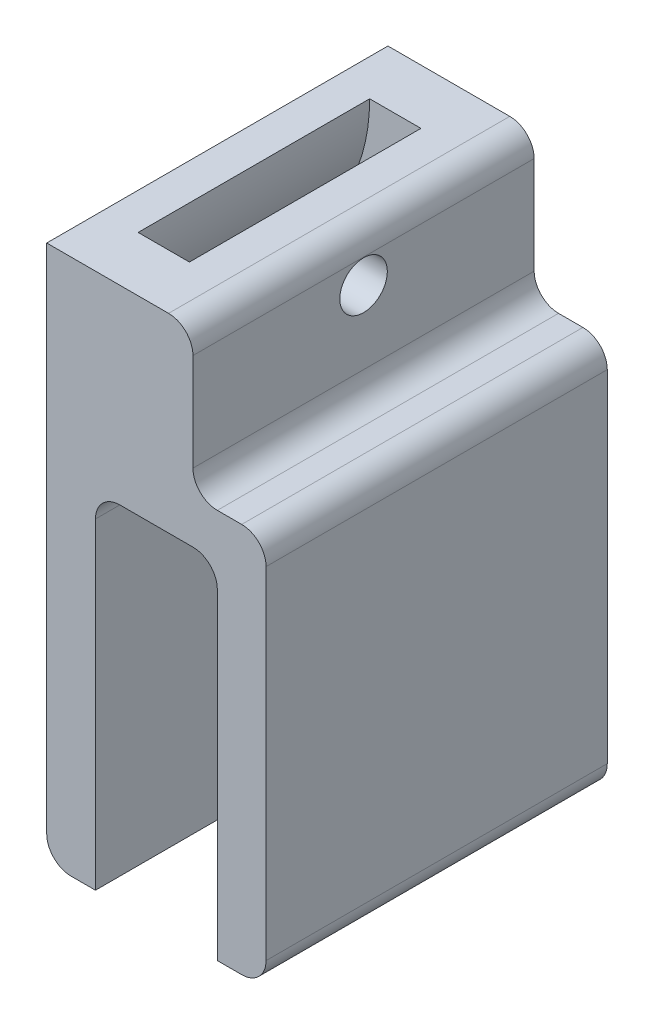
ISO-10303-21;
HEADER;
FILE_DESCRIPTION(('STEP AP214'),'2;1');
FILE_NAME('part.step','',(''),(''),'','','');
FILE_SCHEMA(('AUTOMOTIVE_DESIGN { 1 0 10303 214 1 1 1 1 }'));
ENDSEC;
DATA;
#1=APPLICATION_CONTEXT('core data for automotive mechanical design processes');
#2=APPLICATION_PROTOCOL_DEFINITION('international standard','automotive_design',2000,#1);
#3=PRODUCT_CONTEXT('',#1,'mechanical');
#4=PRODUCT('Part','Part','',(#3));
#5=PRODUCT_RELATED_PRODUCT_CATEGORY('part','',(#4));
#6=PRODUCT_DEFINITION_FORMATION('','',#4);
#7=PRODUCT_DEFINITION_CONTEXT('part definition',#1,'design');
#8=PRODUCT_DEFINITION('design','',#6,#7);
#9=PRODUCT_DEFINITION_SHAPE('','',#8);
#10=(LENGTH_UNIT() NAMED_UNIT(*) SI_UNIT(.MILLI.,.METRE.));
#11=(NAMED_UNIT(*) PLANE_ANGLE_UNIT() SI_UNIT($,.RADIAN.));
#12=(NAMED_UNIT(*) SI_UNIT($,.STERADIAN.) SOLID_ANGLE_UNIT());
#13=UNCERTAINTY_MEASURE_WITH_UNIT(LENGTH_MEASURE(1.E-05),#10,'distance_accuracy_value','');
#14=(GEOMETRIC_REPRESENTATION_CONTEXT(3) GLOBAL_UNCERTAINTY_ASSIGNED_CONTEXT((#13)) GLOBAL_UNIT_ASSIGNED_CONTEXT((#10,
#11,#12)) REPRESENTATION_CONTEXT('',''));
#15=CARTESIAN_POINT('',(0.,0.,0.));
#16=DIRECTION('',(0.,0.,1.));
#17=DIRECTION('',(1.,0.,0.));
#18=AXIS2_PLACEMENT_3D('',#15,#16,#17);
#19=CARTESIAN_POINT('',(1.,-15.,14.));
#20=DIRECTION('',(0.,0.,-1.));
#21=DIRECTION('',(-1.,0.,0.));
#22=AXIS2_PLACEMENT_3D('',#19,#20,#21);
#23=CYLINDRICAL_SURFACE('',#22,1.);
#24=DIRECTION('',(0.,0.,-1.));
#25=VECTOR('',#24,1.);
#26=CARTESIAN_POINT('',(1.00000000000001,-16.,14.));
#27=LINE('',#26,#25);
#28=CARTESIAN_POINT('',(1.,-16.,2.25));
#29=VERTEX_POINT('',#28);
#30=CARTESIAN_POINT('',(1.00000000000001,-16.,0.));
#31=VERTEX_POINT('',#30);
#32=EDGE_CURVE('E227',#29,#31,#27,.T.);
#33=ORIENTED_EDGE('',*,*,#32,.F.);
#34=CARTESIAN_POINT('',(1.,-15.,2.25));
#35=DIRECTION('',(0.,0.,-1.));
#36=DIRECTION('',(-1.,0.,0.));
#37=AXIS2_PLACEMENT_3D('',#34,#35,#36);
#38=CIRCLE('',#37,1.);
#39=CARTESIAN_POINT('',(0.,-15.,2.25));
#40=VERTEX_POINT('',#39);
#41=EDGE_CURVE('E215',#29,#40,#38,.T.);
#42=ORIENTED_EDGE('',*,*,#41,.T.);
#43=DIRECTION('',(0.,0.,-1.));
#44=VECTOR('',#43,1.);
#45=CARTESIAN_POINT('',(0.,-15.,14.));
#46=LINE('',#45,#44);
#47=CARTESIAN_POINT('',(0.,-15.,0.));
#48=VERTEX_POINT('',#47);
#49=EDGE_CURVE('E437',#40,#48,#46,.T.);
#50=ORIENTED_EDGE('',*,*,#49,.T.);
#51=CARTESIAN_POINT('',(1.,-15.,0.));
#52=DIRECTION('',(0.,0.,1.));
#53=DIRECTION('',(1.,0.,0.));
#54=AXIS2_PLACEMENT_3D('',#51,#52,#53);
#55=CIRCLE('',#54,1.);
#56=EDGE_CURVE('E229',#48,#31,#55,.T.);
#57=ORIENTED_EDGE('',*,*,#56,.T.);
#58=EDGE_LOOP('',(#33,#42,#50,#57));
#59=FACE_BOUND('',#58,.T.);
#60=ADVANCED_FACE('F43',(#59),#23,.T.);
#61=CARTESIAN_POINT('',(-6.,6.,14.));
#62=DIRECTION('',(0.,0.,1.));
#63=DIRECTION('',(1.,0.,0.));
#64=AXIS2_PLACEMENT_3D('',#61,#62,#63);
#65=CYLINDRICAL_SURFACE('',#64,9.60468635614927);
#66=CARTESIAN_POINT('',(3.54983638603301,4.975,7.));
#67=CARTESIAN_POINT('',(3.54983654030874,4.97499765923591,7.05447231909545));
#68=CARTESIAN_POINT('',(3.54934821209866,4.97041968657314,7.10898064716998));
#69=CARTESIAN_POINT('',(3.54736880381986,4.95222641165071,7.21649130415558));
#70=CARTESIAN_POINT('',(3.54587662240932,4.9386011837302,7.26949191228875));
#71=CARTESIAN_POINT('',(3.54181811341177,4.90271642328877,7.37241888516331));
#72=CARTESIAN_POINT('',(3.53925227655186,4.88046083571721,7.42234664244431));
#73=CARTESIAN_POINT('',(3.53294624495043,4.82797996611845,7.51772251808905));
#74=CARTESIAN_POINT('',(3.5292063269554,4.79775656247985,7.56317168880137));
#75=CARTESIAN_POINT('',(3.52044099785097,4.7302125323965,7.64836058331503));
#76=CARTESIAN_POINT('',(3.51541465373154,4.69288675985773,7.68809613037267));
#77=CARTESIAN_POINT('',(3.50399104781962,4.61226505089509,7.76072364824368));
#78=CARTESIAN_POINT('',(3.49759373451121,4.5689688901481,7.79361536179973));
#79=CARTESIAN_POINT('',(3.48335901753042,4.47748533616389,7.85181273167091));
#80=CARTESIAN_POINT('',(3.47551529371861,4.42927690917059,7.87708375978909));
#81=CARTESIAN_POINT('',(3.45844300264154,4.32954687960288,7.91921422709139));
#82=CARTESIAN_POINT('',(3.4492143648559,4.278025108388,7.93607323774288));
#83=CARTESIAN_POINT('',(3.42937094334267,4.17246546422073,7.96117706650691));
#84=CARTESIAN_POINT('',(3.41873997446763,4.118403873929,7.96930921857102));
#85=CARTESIAN_POINT('',(3.39641281472078,4.00990069386823,7.97646516150323));
#86=CARTESIAN_POINT('',(3.38471650157542,3.95545906114409,7.97548790554279));
#87=CARTESIAN_POINT('',(3.36032475804199,3.84651407788624,7.96443133741383));
#88=CARTESIAN_POINT('',(3.34761342704867,3.79203378076364,7.95415993055693));
#89=CARTESIAN_POINT('',(3.32184749575125,3.68566272953433,7.92458940475705));
#90=CARTESIAN_POINT('',(3.3087928476682,3.6337723388044,7.90528902292245));
#91=CARTESIAN_POINT('',(3.28261566303421,3.53305784188207,7.85775636175943));
#92=CARTESIAN_POINT('',(3.26949614255724,3.48430584385074,7.82936939045021));
#93=CARTESIAN_POINT('',(3.24402932362007,3.39227978544993,7.76450643648993));
#94=CARTESIAN_POINT('',(3.23168205240017,3.3490059182608,7.72803016870334));
#95=CARTESIAN_POINT('',(3.2084551574588,3.26941999160748,7.64810685637921));
#96=CARTESIAN_POINT('',(3.19756872444456,3.23307527438886,7.60469437837582));
#97=CARTESIAN_POINT('',(3.17782646398492,3.1682774184293,7.5119196051189));
#98=CARTESIAN_POINT('',(3.16897018463755,3.13982252315767,7.46255863770875));
#99=CARTESIAN_POINT('',(3.15413100592176,3.09268553315065,7.36113808758908));
#100=CARTESIAN_POINT('',(3.14805723317411,3.07369226233307,7.3092365944666));
#101=CARTESIAN_POINT('',(3.13873830526483,3.04471705605947,7.20273655754587));
#102=CARTESIAN_POINT('',(3.13549227182808,3.03473232258326,7.14813885674118));
#103=CARTESIAN_POINT('',(3.13213035559415,3.02439538030788,7.04032947386713));
#104=CARTESIAN_POINT('',(3.13188554839029,3.02364641963207,6.98715952780095));
#105=CARTESIAN_POINT('',(3.13420873708317,3.0307838376518,6.88146933238586));
#106=CARTESIAN_POINT('',(3.13677644011061,3.03866931723506,6.82894901596628));
#107=CARTESIAN_POINT('',(3.14450043637465,3.06260913711738,6.72680215465763));
#108=CARTESIAN_POINT('',(3.1496195732731,3.0785462660648,6.67714517141976));
#109=CARTESIAN_POINT('',(3.16211772278648,3.11798259991648,6.58124046183783));
#110=CARTESIAN_POINT('',(3.1694969778997,3.14148261629083,6.53499310198859));
#111=CARTESIAN_POINT('',(3.18632151928051,3.19601549150868,6.44589490445011));
#112=CARTESIAN_POINT('',(3.19581547507336,3.22722809726801,6.40316343649703));
#113=CARTESIAN_POINT('',(3.21625041298274,3.29592703237969,6.32348302674362));
#114=CARTESIAN_POINT('',(3.22719170731665,3.33341471584539,6.28653533637525));
#115=CARTESIAN_POINT('',(3.25050644740504,3.41542599050691,6.21776896043653));
#116=CARTESIAN_POINT('',(3.26292165715062,3.46018604248259,6.18624626663587));
#117=CARTESIAN_POINT('',(3.28819969319982,3.55424511891968,6.13115037404116));
#118=CARTESIAN_POINT('',(3.30106259938319,3.6035449559965,6.10757860198622));
#119=CARTESIAN_POINT('',(3.32709390086703,3.70691481111203,6.06840472997474));
#120=CARTESIAN_POINT('',(3.34026007792542,3.76108279438388,6.05305899500714));
#121=CARTESIAN_POINT('',(3.36601334735681,3.87138534670266,6.03189000496204));
#122=CARTESIAN_POINT('',(3.378600427469,3.92751995734328,6.02606695141127));
#123=CARTESIAN_POINT('',(3.40278202337554,4.04015152975417,6.02420104957862));
#124=CARTESIAN_POINT('',(3.41437686442026,4.09664836621085,6.0281549836519));
#125=CARTESIAN_POINT('',(3.43627176452015,4.20834875580097,6.04584482013082));
#126=CARTESIAN_POINT('',(3.44657196434991,4.26355244901409,6.05957965791195));
#127=CARTESIAN_POINT('',(3.46549384696576,4.36988137607817,6.09616903647167));
#128=CARTESIAN_POINT('',(3.47414507128788,4.42106623222123,6.11883499194005));
#129=CARTESIAN_POINT('',(3.48994365013321,4.51897642042101,6.17270962042132));
#130=CARTESIAN_POINT('',(3.4970912271076,4.56570241156728,6.20391702822863));
#131=CARTESIAN_POINT('',(3.50976842934507,4.65234025419154,6.27329824839414));
#132=CARTESIAN_POINT('',(3.5153277939297,4.69237058585842,6.31131877139638));
#133=CARTESIAN_POINT('',(3.52509500081151,4.76552402696147,6.39367416387762));
#134=CARTESIAN_POINT('',(3.5293026162104,4.79864597646193,6.43801009163007));
#135=CARTESIAN_POINT('',(3.53643675482766,4.85666166364111,6.53123441286501));
#136=CARTESIAN_POINT('',(3.53937576599784,4.88163498933292,6.58007240328522));
#137=CARTESIAN_POINT('',(3.54413947642016,4.92304134276015,6.68125084241746));
#138=CARTESIAN_POINT('',(3.54596542583934,4.93948394891312,6.73358728812121));
#139=CARTESIAN_POINT('',(3.54813648666241,4.9592561157567,6.82184826605894));
#140=CARTESIAN_POINT('',(3.548775078046,4.96515199161104,6.85721227074612));
#141=CARTESIAN_POINT('',(3.54962497682726,4.97302470164829,6.92837899410916));
#142=CARTESIAN_POINT('',(3.54983628458896,4.97500153917004,6.96418171241123));
#143=CARTESIAN_POINT('',(3.54983638603301,4.975,7.));
#144=B_SPLINE_CURVE_WITH_KNOTS('',3,(#66,#67,#68,#69,#70,#71,#72,#73,#74,#75,#76,#77,#78,#79,
#80,#81,#82,#83,#84,#85,#86,#87,#88,#89,#90,#91,#92,#93,#94,#95,#96,#97,#98,#99,#100,#101,#102,
#103,#104,#105,#106,#107,#108,#109,#110,#111,#112,#113,#114,#115,#116,#117,#118,#119,#120,#121,
#122,#123,#124,#125,#126,#127,#128,#129,#130,#131,#132,#133,#134,#135,#136,#137,#138,#139,#140,
#141,#142,#143),.UNSPECIFIED.,.T.,.F.,(4,2,2,2,2,2,2,2,2,2,2,2,2,2,2,2,2,2,2,2,2,2,2,2,2,2,2,2,
2,2,2,2,2,2,2,2,2,2,4),(0.,0.163286544600321,0.326752526007672,0.490143874798602,
0.653496738963686,0.816968415943527,0.980446236656639,1.14465607520607,1.308874278228,
1.47518797829279,1.64152079091418,1.81137197113816,1.98124691572034,2.15418313912827,
2.32712545924717,2.49923136439582,2.67129892235669,2.83725581922321,3.00316115269537,
3.16191335990958,3.32064903768097,3.47713778995856,3.63364333850653,3.79421255191043,
3.95481645968593,4.1224636367053,4.29014088089256,4.46277797040424,4.63541871335547,
4.80800264712612,4.98056779848004,5.14966920304122,5.31874557294177,5.48441000955807,
5.65010223932107,5.81412400562731,5.97796120512279,6.08533040646702,6.19269951633773),.UNSPECIFIED.);
#145=CARTESIAN_POINT('',(3.54983638603301,4.975,7.));
#146=VERTEX_POINT('',#145);
#147=EDGE_CURVE('E251',#146,#146,#144,.T.);
#148=ORIENTED_EDGE('',*,*,#147,.T.);
#149=EDGE_LOOP('',(#148));
#150=FACE_BOUND('',#149,.T.);
#151=CARTESIAN_POINT('',(-6.,6.,2.25));
#152=DIRECTION('',(0.,0.,1.));
#153=DIRECTION('',(0.624695047554424,-0.78086880944303,0.));
#154=AXIS2_PLACEMENT_3D('',#151,#152,#153);
#155=CIRCLE('',#154,9.60468635614927);
#156=CARTESIAN_POINT('',(1.76582033218927,0.34827154154097,2.25));
#157=VERTEX_POINT('',#156);
#158=CARTESIAN_POINT('',(3.60468635614927,6.,2.25));
#159=VERTEX_POINT('',#158);
#160=EDGE_CURVE('E258',#157,#159,#155,.T.);
#161=ORIENTED_EDGE('',*,*,#160,.F.);
#162=DIRECTION('',(0.,0.,1.));
#163=VECTOR('',#162,1.);
#164=CARTESIAN_POINT('',(1.76582033218927,0.348271541540971,14.));
#165=LINE('',#164,#163);
#166=CARTESIAN_POINT('',(1.76582033218927,0.34827154154097,11.75));
#167=VERTEX_POINT('',#166);
#168=EDGE_CURVE('E65',#157,#167,#165,.T.);
#169=ORIENTED_EDGE('',*,*,#168,.T.);
#170=CARTESIAN_POINT('',(-6.,6.,11.75));
#171=DIRECTION('',(0.,0.,1.));
#172=DIRECTION('',(0.624695047554424,-0.78086880944303,0.));
#173=AXIS2_PLACEMENT_3D('',#170,#171,#172);
#174=CIRCLE('',#173,9.60468635614927);
#175=CARTESIAN_POINT('',(3.60468635614927,6.,11.75));
#176=VERTEX_POINT('',#175);
#177=EDGE_CURVE('E255',#167,#176,#174,.T.);
#178=ORIENTED_EDGE('',*,*,#177,.T.);
#179=DIRECTION('',(0.,0.,1.));
#180=VECTOR('',#179,1.);
#181=CARTESIAN_POINT('',(3.60468635614927,6.,14.));
#182=LINE('',#181,#180);
#183=EDGE_CURVE('E446',#159,#176,#182,.T.);
#184=ORIENTED_EDGE('',*,*,#183,.F.);
#185=EDGE_LOOP('',(#161,#169,#178,#184));
#186=FACE_BOUND('',#185,.T.);
#187=ADVANCED_FACE('F467',(#150,#186),#65,.F.);
#188=CARTESIAN_POINT('',(0.,0.,14.));
#189=DIRECTION('',(1.,0.,0.));
#190=DIRECTION('',(0.,1.,0.));
#191=AXIS2_PLACEMENT_3D('',#188,#189,#190);
#192=PLANE('',#191);
#193=ORIENTED_EDGE('',*,*,#49,.F.);
#194=DIRECTION('',(0.,-1.,0.));
#195=VECTOR('',#194,1.);
#196=CARTESIAN_POINT('',(0.,1.5,2.25));
#197=LINE('',#196,#195);
#198=CARTESIAN_POINT('',(0.,1.5,2.25));
#199=VERTEX_POINT('',#198);
#200=EDGE_CURVE('E219',#40,#199,#197,.F.);
#201=ORIENTED_EDGE('',*,*,#200,.T.);
#202=DIRECTION('',(0.,0.,1.));
#203=VECTOR('',#202,1.);
#204=CARTESIAN_POINT('',(0.,1.5,2.25));
#205=LINE('',#204,#203);
#206=CARTESIAN_POINT('',(0.,1.5,11.75));
#207=VERTEX_POINT('',#206);
#208=EDGE_CURVE('E262',#199,#207,#205,.T.);
#209=ORIENTED_EDGE('',*,*,#208,.T.);
#210=DIRECTION('',(0.,-1.,0.));
#211=VECTOR('',#210,1.);
#212=CARTESIAN_POINT('',(0.,1.5,11.75));
#213=LINE('',#212,#211);
#214=CARTESIAN_POINT('',(0.,-15.,11.75));
#215=VERTEX_POINT('',#214);
#216=EDGE_CURVE('E252',#207,#215,#213,.T.);
#217=ORIENTED_EDGE('',*,*,#216,.T.);
#218=CARTESIAN_POINT('',(0.,-15.,14.));
#219=VERTEX_POINT('',#218);
#220=EDGE_CURVE('E438',#219,#215,#46,.T.);
#221=ORIENTED_EDGE('',*,*,#220,.F.);
#222=DIRECTION('',(0.,-1.,0.));
#223=VECTOR('',#222,1.);
#224=CARTESIAN_POINT('',(0.,0.,14.));
#225=LINE('',#224,#223);
#226=CARTESIAN_POINT('',(0.,6.,14.));
#227=VERTEX_POINT('',#226);
#228=EDGE_CURVE('E275',#227,#219,#225,.T.);
#229=ORIENTED_EDGE('',*,*,#228,.F.);
#230=DIRECTION('',(0.,0.,-1.));
#231=VECTOR('',#230,1.);
#232=CARTESIAN_POINT('',(0.,6.,14.));
#233=LINE('',#232,#231);
#234=CARTESIAN_POINT('',(0.,6.,0.));
#235=VERTEX_POINT('',#234);
#236=EDGE_CURVE('E327',#227,#235,#233,.T.);
#237=ORIENTED_EDGE('',*,*,#236,.T.);
#238=DIRECTION('',(0.,-1.,0.));
#239=VECTOR('',#238,1.);
#240=CARTESIAN_POINT('',(0.,0.,0.));
#241=LINE('',#240,#239);
#242=EDGE_CURVE('E271',#235,#48,#241,.T.);
#243=ORIENTED_EDGE('',*,*,#242,.T.);
#244=EDGE_LOOP('',(#193,#201,#209,#217,#221,#229,#237,#243));
#245=FACE_BOUND('',#244,.T.);
#246=ADVANCED_FACE('F490',(#245),#192,.F.);
#247=ORIENTED_EDGE('',*,*,#220,.T.);
#248=CARTESIAN_POINT('',(1.,-15.,11.75));
#249=DIRECTION('',(0.,0.,1.));
#250=DIRECTION('',(1.,0.,0.));
#251=AXIS2_PLACEMENT_3D('',#248,#249,#250);
#252=CIRCLE('',#251,1.);
#253=CARTESIAN_POINT('',(1.,-16.,11.75));
#254=VERTEX_POINT('',#253);
#255=EDGE_CURVE('E224',#215,#254,#252,.T.);
#256=ORIENTED_EDGE('',*,*,#255,.T.);
#257=CARTESIAN_POINT('',(1.00000000000001,-16.,14.));
#258=VERTEX_POINT('',#257);
#259=EDGE_CURVE('E233',#258,#254,#27,.T.);
#260=ORIENTED_EDGE('',*,*,#259,.F.);
#261=CARTESIAN_POINT('',(1.,-15.,14.));
#262=DIRECTION('',(0.,0.,1.));
#263=DIRECTION('',(1.,0.,0.));
#264=AXIS2_PLACEMENT_3D('',#261,#262,#263);
#265=CIRCLE('',#264,1.);
#266=EDGE_CURVE('E278',#219,#258,#265,.T.);
#267=ORIENTED_EDGE('',*,*,#266,.F.);
#268=EDGE_LOOP('',(#247,#256,#260,#267));
#269=FACE_BOUND('',#268,.T.);
#270=ADVANCED_FACE('F486',(#269),#23,.T.);
#271=CARTESIAN_POINT('',(1.00000000000001,-16.,14.));
#272=DIRECTION('',(0.,1.,0.));
#273=DIRECTION('',(0.,0.,1.));
#274=AXIS2_PLACEMENT_3D('',#271,#272,#273);
#275=PLANE('',#274);
#276=DIRECTION('',(1.,0.,0.));
#277=VECTOR('',#276,1.);
#278=CARTESIAN_POINT('',(1.00000000000001,-16.,0.));
#279=LINE('',#278,#277);
#280=CARTESIAN_POINT('',(2.,-16.,0.));
#281=VERTEX_POINT('',#280);
#282=EDGE_CURVE('E333',#31,#281,#279,.T.);
#283=ORIENTED_EDGE('',*,*,#282,.T.);
#284=DIRECTION('',(0.,0.,-1.));
#285=VECTOR('',#284,1.);
#286=CARTESIAN_POINT('',(2.,-16.,14.));
#287=LINE('',#286,#285);
#288=CARTESIAN_POINT('',(2.,-16.,14.));
#289=VERTEX_POINT('',#288);
#290=EDGE_CURVE('E234',#289,#281,#287,.T.);
#291=ORIENTED_EDGE('',*,*,#290,.F.);
#292=DIRECTION('',(1.,0.,0.));
#293=VECTOR('',#292,1.);
#294=CARTESIAN_POINT('',(1.00000000000001,-16.,14.));
#295=LINE('',#294,#293);
#296=EDGE_CURVE('E282',#258,#289,#295,.T.);
#297=ORIENTED_EDGE('',*,*,#296,.F.);
#298=ORIENTED_EDGE('',*,*,#259,.T.);
#299=DIRECTION('',(0.,0.,1.));
#300=VECTOR('',#299,1.);
#301=CARTESIAN_POINT('',(1.,-16.,2.25));
#302=LINE('',#301,#300);
#303=EDGE_CURVE('E208',#29,#254,#302,.T.);
#304=ORIENTED_EDGE('',*,*,#303,.F.);
#305=ORIENTED_EDGE('',*,*,#32,.T.);
#306=EDGE_LOOP('',(#283,#291,#297,#298,#304,#305));
#307=FACE_BOUND('',#306,.T.);
#308=ADVANCED_FACE('F237',(#307),#275,.F.);
#309=CARTESIAN_POINT('',(2.,-16.,14.));
#310=DIRECTION('',(-1.,0.,0.));
#311=DIRECTION('',(0.,0.,1.));
#312=AXIS2_PLACEMENT_3D('',#309,#310,#311);
#313=PLANE('',#312);
#314=DIRECTION('',(0.,1.,0.));
#315=VECTOR('',#314,1.);
#316=CARTESIAN_POINT('',(2.,-16.,0.));
#317=LINE('',#316,#315);
#318=CARTESIAN_POINT('',(2.,-2.80681818181819,0.));
#319=VERTEX_POINT('',#318);
#320=EDGE_CURVE('E336',#281,#319,#317,.T.);
#321=ORIENTED_EDGE('',*,*,#320,.T.);
#322=DIRECTION('',(0.,0.,-1.));
#323=VECTOR('',#322,1.);
#324=CARTESIAN_POINT('',(2.,-2.80681818181819,14.));
#325=LINE('',#324,#323);
#326=CARTESIAN_POINT('',(2.,-2.80681818181819,14.));
#327=VERTEX_POINT('',#326);
#328=EDGE_CURVE('E429',#327,#319,#325,.T.);
#329=ORIENTED_EDGE('',*,*,#328,.F.);
#330=DIRECTION('',(0.,1.,0.));
#331=VECTOR('',#330,1.);
#332=CARTESIAN_POINT('',(2.,-16.,14.));
#333=LINE('',#332,#331);
#334=EDGE_CURVE('E285',#289,#327,#333,.T.);
#335=ORIENTED_EDGE('',*,*,#334,.F.);
#336=ORIENTED_EDGE('',*,*,#290,.T.);
#337=EDGE_LOOP('',(#321,#329,#335,#336));
#338=FACE_BOUND('',#337,.T.);
#339=ADVANCED_FACE('F499',(#338),#313,.F.);
#340=CARTESIAN_POINT('',(3.,-2.80681818181818,14.));
#341=DIRECTION('',(0.,0.,-1.));
#342=DIRECTION('',(-1.,0.,0.));
#343=AXIS2_PLACEMENT_3D('',#340,#341,#342);
#344=CYLINDRICAL_SURFACE('',#343,1.);
#345=CARTESIAN_POINT('',(3.,-2.80681818181818,0.));
#346=DIRECTION('',(0.,0.,-1.));
#347=DIRECTION('',(-1.,0.,0.));
#348=AXIS2_PLACEMENT_3D('',#345,#346,#347);
#349=CIRCLE('',#348,1.);
#350=CARTESIAN_POINT('',(3.00000000000001,-1.80681818181818,0.));
#351=VERTEX_POINT('',#350);
#352=EDGE_CURVE('E339',#319,#351,#349,.T.);
#353=ORIENTED_EDGE('',*,*,#352,.T.);
#354=DIRECTION('',(0.,0.,-1.));
#355=VECTOR('',#354,1.);
#356=CARTESIAN_POINT('',(3.00000000000001,-1.80681818181818,14.));
#357=LINE('',#356,#355);
#358=CARTESIAN_POINT('',(3.00000000000001,-1.80681818181818,14.));
#359=VERTEX_POINT('',#358);
#360=EDGE_CURVE('E425',#359,#351,#357,.T.);
#361=ORIENTED_EDGE('',*,*,#360,.F.);
#362=CARTESIAN_POINT('',(3.,-2.80681818181818,14.));
#363=DIRECTION('',(0.,0.,-1.));
#364=DIRECTION('',(-1.,0.,0.));
#365=AXIS2_PLACEMENT_3D('',#362,#363,#364);
#366=CIRCLE('',#365,1.);
#367=EDGE_CURVE('E288',#327,#359,#366,.T.);
#368=ORIENTED_EDGE('',*,*,#367,.F.);
#369=ORIENTED_EDGE('',*,*,#328,.T.);
#370=EDGE_LOOP('',(#353,#361,#368,#369));
#371=FACE_BOUND('',#370,.T.);
#372=ADVANCED_FACE('F585',(#371),#344,.F.);
#373=CARTESIAN_POINT('',(3.00000000000001,-1.80681818181818,14.));
#374=DIRECTION('',(0.,1.,0.));
#375=DIRECTION('',(0.,0.,1.));
#376=AXIS2_PLACEMENT_3D('',#373,#374,#375);
#377=PLANE('',#376);
#378=DIRECTION('',(1.,0.,0.));
#379=VECTOR('',#378,1.);
#380=CARTESIAN_POINT('',(3.00000000000001,-1.80681818181818,0.));
#381=LINE('',#380,#379);
#382=CARTESIAN_POINT('',(5.99999999999999,-1.80681818181818,0.));
#383=VERTEX_POINT('',#382);
#384=EDGE_CURVE('E342',#351,#383,#381,.T.);
#385=ORIENTED_EDGE('',*,*,#384,.T.);
#386=DIRECTION('',(0.,0.,-1.));
#387=VECTOR('',#386,1.);
#388=CARTESIAN_POINT('',(5.99999999999999,-1.80681818181818,14.));
#389=LINE('',#388,#387);
#390=CARTESIAN_POINT('',(5.99999999999999,-1.80681818181818,14.));
#391=VERTEX_POINT('',#390);
#392=EDGE_CURVE('E421',#391,#383,#389,.T.);
#393=ORIENTED_EDGE('',*,*,#392,.F.);
#394=DIRECTION('',(1.,0.,0.));
#395=VECTOR('',#394,1.);
#396=CARTESIAN_POINT('',(3.00000000000001,-1.80681818181818,14.));
#397=LINE('',#396,#395);
#398=EDGE_CURVE('E291',#359,#391,#397,.T.);
#399=ORIENTED_EDGE('',*,*,#398,.F.);
#400=ORIENTED_EDGE('',*,*,#360,.T.);
#401=EDGE_LOOP('',(#385,#393,#399,#400));
#402=FACE_BOUND('',#401,.T.);
#403=ADVANCED_FACE('F583',(#402),#377,.F.);
#404=CARTESIAN_POINT('',(6.,-2.80681818181818,14.));
#405=DIRECTION('',(0.,0.,-1.));
#406=DIRECTION('',(-1.,0.,0.));
#407=AXIS2_PLACEMENT_3D('',#404,#405,#406);
#408=CYLINDRICAL_SURFACE('',#407,1.);
#409=CARTESIAN_POINT('',(6.,-2.80681818181818,0.));
#410=DIRECTION('',(0.,0.,-1.));
#411=DIRECTION('',(-1.,0.,0.));
#412=AXIS2_PLACEMENT_3D('',#409,#410,#411);
#413=CIRCLE('',#412,1.);
#414=CARTESIAN_POINT('',(7.,-2.80681818181819,0.));
#415=VERTEX_POINT('',#414);
#416=EDGE_CURVE('E345',#383,#415,#413,.T.);
#417=ORIENTED_EDGE('',*,*,#416,.T.);
#418=DIRECTION('',(0.,0.,-1.));
#419=VECTOR('',#418,1.);
#420=CARTESIAN_POINT('',(7.,-2.80681818181819,14.));
#421=LINE('',#420,#419);
#422=CARTESIAN_POINT('',(7.,-2.80681818181819,14.));
#423=VERTEX_POINT('',#422);
#424=EDGE_CURVE('E417',#423,#415,#421,.T.);
#425=ORIENTED_EDGE('',*,*,#424,.F.);
#426=CARTESIAN_POINT('',(6.,-2.80681818181818,14.));
#427=DIRECTION('',(0.,0.,-1.));
#428=DIRECTION('',(-1.,0.,0.));
#429=AXIS2_PLACEMENT_3D('',#426,#427,#428);
#430=CIRCLE('',#429,1.);
#431=EDGE_CURVE('E294',#391,#423,#430,.T.);
#432=ORIENTED_EDGE('',*,*,#431,.F.);
#433=ORIENTED_EDGE('',*,*,#392,.T.);
#434=EDGE_LOOP('',(#417,#425,#432,#433));
#435=FACE_BOUND('',#434,.T.);
#436=ADVANCED_FACE('F578',(#435),#408,.F.);
#437=CARTESIAN_POINT('',(7.,-16.,14.));
#438=DIRECTION('',(1.,0.,0.));
#439=DIRECTION('',(0.,0.,-1.));
#440=AXIS2_PLACEMENT_3D('',#437,#438,#439);
#441=PLANE('',#440);
#442=DIRECTION('',(0.,-1.,0.));
#443=VECTOR('',#442,1.);
#444=CARTESIAN_POINT('',(7.,-16.,0.));
#445=LINE('',#444,#443);
#446=CARTESIAN_POINT('',(7.,-16.,0.));
#447=VERTEX_POINT('',#446);
#448=EDGE_CURVE('E348',#415,#447,#445,.T.);
#449=ORIENTED_EDGE('',*,*,#448,.T.);
#450=DIRECTION('',(0.,0.,-1.));
#451=VECTOR('',#450,1.);
#452=CARTESIAN_POINT('',(7.,-16.,14.));
#453=LINE('',#452,#451);
#454=CARTESIAN_POINT('',(7.,-16.,14.));
#455=VERTEX_POINT('',#454);
#456=EDGE_CURVE('E413',#455,#447,#453,.T.);
#457=ORIENTED_EDGE('',*,*,#456,.F.);
#458=DIRECTION('',(0.,-1.,0.));
#459=VECTOR('',#458,1.);
#460=CARTESIAN_POINT('',(7.,-16.,14.));
#461=LINE('',#460,#459);
#462=EDGE_CURVE('E297',#423,#455,#461,.T.);
#463=ORIENTED_EDGE('',*,*,#462,.F.);
#464=ORIENTED_EDGE('',*,*,#424,.T.);
#465=EDGE_LOOP('',(#449,#457,#463,#464));
#466=FACE_BOUND('',#465,.T.);
#467=ADVANCED_FACE('F573',(#466),#441,.F.);
#468=CARTESIAN_POINT('',(7.,-16.,14.));
#469=DIRECTION('',(0.,1.,0.));
#470=DIRECTION('',(0.,0.,1.));
#471=AXIS2_PLACEMENT_3D('',#468,#469,#470);
#472=PLANE('',#471);
#473=DIRECTION('',(1.,0.,0.));
#474=VECTOR('',#473,1.);
#475=CARTESIAN_POINT('',(7.,-16.,0.));
#476=LINE('',#475,#474);
#477=CARTESIAN_POINT('',(7.99999999999999,-16.,0.));
#478=VERTEX_POINT('',#477);
#479=EDGE_CURVE('E351',#447,#478,#476,.T.);
#480=ORIENTED_EDGE('',*,*,#479,.T.);
#481=DIRECTION('',(0.,0.,-1.));
#482=VECTOR('',#481,1.);
#483=CARTESIAN_POINT('',(7.99999999999999,-16.,14.));
#484=LINE('',#483,#482);
#485=CARTESIAN_POINT('',(7.99999999999999,-16.,14.));
#486=VERTEX_POINT('',#485);
#487=EDGE_CURVE('E409',#486,#478,#484,.T.);
#488=ORIENTED_EDGE('',*,*,#487,.F.);
#489=DIRECTION('',(1.,0.,0.));
#490=VECTOR('',#489,1.);
#491=CARTESIAN_POINT('',(7.,-16.,14.));
#492=LINE('',#491,#490);
#493=EDGE_CURVE('E300',#455,#486,#492,.T.);
#494=ORIENTED_EDGE('',*,*,#493,.F.);
#495=ORIENTED_EDGE('',*,*,#456,.T.);
#496=EDGE_LOOP('',(#480,#488,#494,#495));
#497=FACE_BOUND('',#496,.T.);
#498=ADVANCED_FACE('F569',(#497),#472,.F.);
#499=CARTESIAN_POINT('',(8.,-15.,14.));
#500=DIRECTION('',(0.,0.,-1.));
#501=DIRECTION('',(-1.,0.,0.));
#502=AXIS2_PLACEMENT_3D('',#499,#500,#501);
#503=CYLINDRICAL_SURFACE('',#502,0.999999999999999);
#504=CARTESIAN_POINT('',(8.,-15.,0.));
#505=DIRECTION('',(0.,0.,1.));
#506=DIRECTION('',(1.,0.,0.));
#507=AXIS2_PLACEMENT_3D('',#504,#505,#506);
#508=CIRCLE('',#507,0.999999999999999);
#509=CARTESIAN_POINT('',(9.,-15.,0.));
#510=VERTEX_POINT('',#509);
#511=EDGE_CURVE('E354',#478,#510,#508,.T.);
#512=ORIENTED_EDGE('',*,*,#511,.T.);
#513=DIRECTION('',(0.,0.,-1.));
#514=VECTOR('',#513,1.);
#515=CARTESIAN_POINT('',(9.,-15.,14.));
#516=LINE('',#515,#514);
#517=CARTESIAN_POINT('',(9.,-15.,14.));
#518=VERTEX_POINT('',#517);
#519=EDGE_CURVE('E405',#518,#510,#516,.T.);
#520=ORIENTED_EDGE('',*,*,#519,.F.);
#521=CARTESIAN_POINT('',(8.,-15.,14.));
#522=DIRECTION('',(0.,0.,1.));
#523=DIRECTION('',(1.,0.,0.));
#524=AXIS2_PLACEMENT_3D('',#521,#522,#523);
#525=CIRCLE('',#524,0.999999999999999);
#526=EDGE_CURVE('E303',#486,#518,#525,.T.);
#527=ORIENTED_EDGE('',*,*,#526,.F.);
#528=ORIENTED_EDGE('',*,*,#487,.T.);
#529=EDGE_LOOP('',(#512,#520,#527,#528));
#530=FACE_BOUND('',#529,.T.);
#531=ADVANCED_FACE('F564',(#530),#503,.T.);
#532=CARTESIAN_POINT('',(9.,-1.00000000000001,14.));
#533=DIRECTION('',(-1.,0.,0.));
#534=DIRECTION('',(0.,0.,1.));
#535=AXIS2_PLACEMENT_3D('',#532,#533,#534);
#536=PLANE('',#535);
#537=DIRECTION('',(0.,1.,0.));
#538=VECTOR('',#537,1.);
#539=CARTESIAN_POINT('',(9.,-1.00000000000001,0.));
#540=LINE('',#539,#538);
#541=CARTESIAN_POINT('',(9.,-1.00000000000001,0.));
#542=VERTEX_POINT('',#541);
#543=EDGE_CURVE('E357',#510,#542,#540,.T.);
#544=ORIENTED_EDGE('',*,*,#543,.T.);
#545=DIRECTION('',(0.,0.,-1.));
#546=VECTOR('',#545,1.);
#547=CARTESIAN_POINT('',(9.,-1.00000000000001,14.));
#548=LINE('',#547,#546);
#549=CARTESIAN_POINT('',(9.,-1.00000000000001,14.));
#550=VERTEX_POINT('',#549);
#551=EDGE_CURVE('E401',#550,#542,#548,.T.);
#552=ORIENTED_EDGE('',*,*,#551,.F.);
#553=DIRECTION('',(0.,1.,0.));
#554=VECTOR('',#553,1.);
#555=CARTESIAN_POINT('',(9.,-1.00000000000001,14.));
#556=LINE('',#555,#554);
#557=EDGE_CURVE('E306',#518,#550,#556,.T.);
#558=ORIENTED_EDGE('',*,*,#557,.F.);
#559=ORIENTED_EDGE('',*,*,#519,.T.);
#560=EDGE_LOOP('',(#544,#552,#558,#559));
#561=FACE_BOUND('',#560,.T.);
#562=ADVANCED_FACE('F558',(#561),#536,.F.);
#563=CARTESIAN_POINT('',(8.,-1.,14.));
#564=DIRECTION('',(0.,0.,-1.));
#565=DIRECTION('',(-1.,0.,0.));
#566=AXIS2_PLACEMENT_3D('',#563,#564,#565);
#567=CYLINDRICAL_SURFACE('',#566,1.);
#568=CARTESIAN_POINT('',(8.,-1.,0.));
#569=DIRECTION('',(0.,0.,1.));
#570=DIRECTION('',(-1.,0.,0.));
#571=AXIS2_PLACEMENT_3D('',#568,#569,#570);
#572=CIRCLE('',#571,1.);
#573=CARTESIAN_POINT('',(7.99999999999999,0.,0.));
#574=VERTEX_POINT('',#573);
#575=EDGE_CURVE('E360',#542,#574,#572,.T.);
#576=ORIENTED_EDGE('',*,*,#575,.T.);
#577=DIRECTION('',(0.,0.,-1.));
#578=VECTOR('',#577,1.);
#579=CARTESIAN_POINT('',(7.99999999999999,0.,14.));
#580=LINE('',#579,#578);
#581=CARTESIAN_POINT('',(7.99999999999999,0.,14.));
#582=VERTEX_POINT('',#581);
#583=EDGE_CURVE('E397',#582,#574,#580,.T.);
#584=ORIENTED_EDGE('',*,*,#583,.F.);
#585=CARTESIAN_POINT('',(8.,-1.,14.));
#586=DIRECTION('',(0.,0.,1.));
#587=DIRECTION('',(-1.,0.,0.));
#588=AXIS2_PLACEMENT_3D('',#585,#586,#587);
#589=CIRCLE('',#588,1.);
#590=EDGE_CURVE('E309',#550,#582,#589,.T.);
#591=ORIENTED_EDGE('',*,*,#590,.F.);
#592=ORIENTED_EDGE('',*,*,#551,.T.);
#593=EDGE_LOOP('',(#576,#584,#591,#592));
#594=FACE_BOUND('',#593,.T.);
#595=ADVANCED_FACE('F554',(#594),#567,.T.);
#596=CARTESIAN_POINT('',(7.,0.,14.));
#597=DIRECTION('',(0.,-1.,0.));
#598=DIRECTION('',(0.,0.,-1.));
#599=AXIS2_PLACEMENT_3D('',#596,#597,#598);
#600=PLANE('',#599);
#601=DIRECTION('',(-1.,0.,0.));
#602=VECTOR('',#601,1.);
#603=CARTESIAN_POINT('',(7.,0.,0.));
#604=LINE('',#603,#602);
#605=CARTESIAN_POINT('',(7.,0.,0.));
#606=VERTEX_POINT('',#605);
#607=EDGE_CURVE('E363',#574,#606,#604,.T.);
#608=ORIENTED_EDGE('',*,*,#607,.T.);
#609=DIRECTION('',(0.,0.,-1.));
#610=VECTOR('',#609,1.);
#611=CARTESIAN_POINT('',(7.,0.,14.));
#612=LINE('',#611,#610);
#613=CARTESIAN_POINT('',(7.,0.,14.));
#614=VERTEX_POINT('',#613);
#615=EDGE_CURVE('E393',#614,#606,#612,.T.);
#616=ORIENTED_EDGE('',*,*,#615,.F.);
#617=DIRECTION('',(-1.,0.,0.));
#618=VECTOR('',#617,1.);
#619=CARTESIAN_POINT('',(7.,0.,14.));
#620=LINE('',#619,#618);
#621=EDGE_CURVE('E312',#582,#614,#620,.T.);
#622=ORIENTED_EDGE('',*,*,#621,.F.);
#623=ORIENTED_EDGE('',*,*,#583,.T.);
#624=EDGE_LOOP('',(#608,#616,#622,#623));
#625=FACE_BOUND('',#624,.T.);
#626=ADVANCED_FACE('F549',(#625),#600,.F.);
#627=CARTESIAN_POINT('',(7.,1.,14.));
#628=DIRECTION('',(0.,0.,-1.));
#629=DIRECTION('',(-1.,0.,0.));
#630=AXIS2_PLACEMENT_3D('',#627,#628,#629);
#631=CYLINDRICAL_SURFACE('',#630,1.);
#632=CARTESIAN_POINT('',(7.,1.,0.));
#633=DIRECTION('',(0.,0.,-1.));
#634=DIRECTION('',(-1.,0.,0.));
#635=AXIS2_PLACEMENT_3D('',#632,#633,#634);
#636=CIRCLE('',#635,1.);
#637=CARTESIAN_POINT('',(6.,1.,0.));
#638=VERTEX_POINT('',#637);
#639=EDGE_CURVE('E366',#606,#638,#636,.T.);
#640=ORIENTED_EDGE('',*,*,#639,.T.);
#641=DIRECTION('',(0.,0.,-1.));
#642=VECTOR('',#641,1.);
#643=CARTESIAN_POINT('',(6.,1.,14.));
#644=LINE('',#643,#642);
#645=CARTESIAN_POINT('',(6.,1.,14.));
#646=VERTEX_POINT('',#645);
#647=EDGE_CURVE('E389',#646,#638,#644,.T.);
#648=ORIENTED_EDGE('',*,*,#647,.F.);
#649=CARTESIAN_POINT('',(7.,1.,14.));
#650=DIRECTION('',(0.,0.,-1.));
#651=DIRECTION('',(-1.,0.,0.));
#652=AXIS2_PLACEMENT_3D('',#649,#650,#651);
#653=CIRCLE('',#652,1.);
#654=EDGE_CURVE('E315',#614,#646,#653,.T.);
#655=ORIENTED_EDGE('',*,*,#654,.F.);
#656=ORIENTED_EDGE('',*,*,#615,.T.);
#657=EDGE_LOOP('',(#640,#648,#655,#656));
#658=FACE_BOUND('',#657,.T.);
#659=ADVANCED_FACE('F543',(#658),#631,.F.);
#660=CARTESIAN_POINT('',(6.,1.,14.));
#661=DIRECTION('',(-1.,0.,0.));
#662=DIRECTION('',(0.,0.,1.));
#663=AXIS2_PLACEMENT_3D('',#660,#661,#662);
#664=PLANE('',#663);
#665=CARTESIAN_POINT('',(6.,4.,7.));
#666=DIRECTION('',(1.,0.,0.));
#667=DIRECTION('',(0.,1.,0.));
#668=AXIS2_PLACEMENT_3D('',#665,#666,#667);
#669=CIRCLE('',#668,0.975);
#670=CARTESIAN_POINT('',(6.,4.975,7.));
#671=VERTEX_POINT('',#670);
#672=EDGE_CURVE('E223',#671,#671,#669,.T.);
#673=ORIENTED_EDGE('',*,*,#672,.F.);
#674=EDGE_LOOP('',(#673));
#675=FACE_BOUND('',#674,.T.);
#676=DIRECTION('',(0.,1.,0.));
#677=VECTOR('',#676,1.);
#678=CARTESIAN_POINT('',(6.,1.,0.));
#679=LINE('',#678,#677);
#680=CARTESIAN_POINT('',(6.,5.,0.));
#681=VERTEX_POINT('',#680);
#682=EDGE_CURVE('E369',#638,#681,#679,.T.);
#683=ORIENTED_EDGE('',*,*,#682,.T.);
#684=DIRECTION('',(0.,0.,-1.));
#685=VECTOR('',#684,1.);
#686=CARTESIAN_POINT('',(6.,5.,14.));
#687=LINE('',#686,#685);
#688=CARTESIAN_POINT('',(6.,5.,14.));
#689=VERTEX_POINT('',#688);
#690=EDGE_CURVE('E385',#689,#681,#687,.T.);
#691=ORIENTED_EDGE('',*,*,#690,.F.);
#692=DIRECTION('',(0.,1.,0.));
#693=VECTOR('',#692,1.);
#694=CARTESIAN_POINT('',(6.,1.,14.));
#695=LINE('',#694,#693);
#696=EDGE_CURVE('E318',#646,#689,#695,.T.);
#697=ORIENTED_EDGE('',*,*,#696,.F.);
#698=ORIENTED_EDGE('',*,*,#647,.T.);
#699=EDGE_LOOP('',(#683,#691,#697,#698));
#700=FACE_BOUND('',#699,.T.);
#701=ADVANCED_FACE('F539',(#675,#700),#664,.F.);
#702=CARTESIAN_POINT('',(5.,5.,14.));
#703=DIRECTION('',(0.,0.,-1.));
#704=DIRECTION('',(-1.,0.,0.));
#705=AXIS2_PLACEMENT_3D('',#702,#703,#704);
#706=CYLINDRICAL_SURFACE('',#705,1.);
#707=CARTESIAN_POINT('',(5.,5.,0.));
#708=DIRECTION('',(0.,0.,1.));
#709=DIRECTION('',(-1.,0.,0.));
#710=AXIS2_PLACEMENT_3D('',#707,#708,#709);
#711=CIRCLE('',#710,1.);
#712=CARTESIAN_POINT('',(5.,6.,0.));
#713=VERTEX_POINT('',#712);
#714=EDGE_CURVE('E372',#681,#713,#711,.T.);
#715=ORIENTED_EDGE('',*,*,#714,.T.);
#716=DIRECTION('',(0.,0.,-1.));
#717=VECTOR('',#716,1.);
#718=CARTESIAN_POINT('',(5.,6.,14.));
#719=LINE('',#718,#717);
#720=CARTESIAN_POINT('',(5.,6.,14.));
#721=VERTEX_POINT('',#720);
#722=EDGE_CURVE('E381',#721,#713,#719,.T.);
#723=ORIENTED_EDGE('',*,*,#722,.F.);
#724=CARTESIAN_POINT('',(5.,5.,14.));
#725=DIRECTION('',(0.,0.,1.));
#726=DIRECTION('',(-1.,0.,0.));
#727=AXIS2_PLACEMENT_3D('',#724,#725,#726);
#728=CIRCLE('',#727,1.);
#729=EDGE_CURVE('E321',#689,#721,#728,.T.);
#730=ORIENTED_EDGE('',*,*,#729,.F.);
#731=ORIENTED_EDGE('',*,*,#690,.T.);
#732=EDGE_LOOP('',(#715,#723,#730,#731));
#733=FACE_BOUND('',#732,.T.);
#734=ADVANCED_FACE('F535',(#733),#706,.T.);
#735=CARTESIAN_POINT('',(0.,6.,14.));
#736=DIRECTION('',(0.,-1.,0.));
#737=DIRECTION('',(0.,0.,-1.));
#738=AXIS2_PLACEMENT_3D('',#735,#736,#737);
#739=PLANE('',#738);
#740=DIRECTION('',(-1.,0.,0.));
#741=VECTOR('',#740,1.);
#742=CARTESIAN_POINT('',(0.,6.,11.75));
#743=LINE('',#742,#741);
#744=CARTESIAN_POINT('',(1.5,6.,11.75));
#745=VERTEX_POINT('',#744);
#746=EDGE_CURVE('E442',#176,#745,#743,.T.);
#747=ORIENTED_EDGE('',*,*,#746,.T.);
#748=DIRECTION('',(0.,0.,1.));
#749=VECTOR('',#748,1.);
#750=CARTESIAN_POINT('',(1.5,6.,14.));
#751=LINE('',#750,#749);
#752=CARTESIAN_POINT('',(1.5,6.,2.25));
#753=VERTEX_POINT('',#752);
#754=EDGE_CURVE('E454',#745,#753,#751,.F.);
#755=ORIENTED_EDGE('',*,*,#754,.T.);
#756=DIRECTION('',(1.,0.,0.));
#757=VECTOR('',#756,1.);
#758=CARTESIAN_POINT('',(0.,6.,2.25));
#759=LINE('',#758,#757);
#760=EDGE_CURVE('E450',#753,#159,#759,.T.);
#761=ORIENTED_EDGE('',*,*,#760,.T.);
#762=ORIENTED_EDGE('',*,*,#183,.T.);
#763=EDGE_LOOP('',(#747,#755,#761,#762));
#764=FACE_BOUND('',#763,.T.);
#765=DIRECTION('',(-1.,0.,0.));
#766=VECTOR('',#765,1.);
#767=CARTESIAN_POINT('',(0.,6.,0.));
#768=LINE('',#767,#766);
#769=EDGE_CURVE('E279',#713,#235,#768,.T.);
#770=ORIENTED_EDGE('',*,*,#769,.T.);
#771=ORIENTED_EDGE('',*,*,#236,.F.);
#772=DIRECTION('',(-1.,0.,0.));
#773=VECTOR('',#772,1.);
#774=CARTESIAN_POINT('',(0.,6.,14.));
#775=LINE('',#774,#773);
#776=EDGE_CURVE('E324',#721,#227,#775,.T.);
#777=ORIENTED_EDGE('',*,*,#776,.F.);
#778=ORIENTED_EDGE('',*,*,#722,.T.);
#779=EDGE_LOOP('',(#770,#771,#777,#778));
#780=FACE_BOUND('',#779,.T.);
#781=ADVANCED_FACE('F530',(#764,#780),#739,.F.);
#782=CARTESIAN_POINT('',(5.,5.,14.));
#783=DIRECTION('',(0.,0.,-1.));
#784=DIRECTION('',(-1.,0.,0.));
#785=AXIS2_PLACEMENT_3D('',#782,#783,#784);
#786=PLANE('',#785);
#787=ORIENTED_EDGE('',*,*,#228,.T.);
#788=ORIENTED_EDGE('',*,*,#266,.T.);
#789=ORIENTED_EDGE('',*,*,#296,.T.);
#790=ORIENTED_EDGE('',*,*,#334,.T.);
#791=ORIENTED_EDGE('',*,*,#367,.T.);
#792=ORIENTED_EDGE('',*,*,#398,.T.);
#793=ORIENTED_EDGE('',*,*,#431,.T.);
#794=ORIENTED_EDGE('',*,*,#462,.T.);
#795=ORIENTED_EDGE('',*,*,#493,.T.);
#796=ORIENTED_EDGE('',*,*,#526,.T.);
#797=ORIENTED_EDGE('',*,*,#557,.T.);
#798=ORIENTED_EDGE('',*,*,#590,.T.);
#799=ORIENTED_EDGE('',*,*,#621,.T.);
#800=ORIENTED_EDGE('',*,*,#654,.T.);
#801=ORIENTED_EDGE('',*,*,#696,.T.);
#802=ORIENTED_EDGE('',*,*,#729,.T.);
#803=ORIENTED_EDGE('',*,*,#776,.T.);
#804=EDGE_LOOP('',(#787,#788,#789,#790,#791,#792,#793,#794,#795,#796,#797,#798,#799,#800,#801,
#802,#803));
#805=FACE_BOUND('',#804,.T.);
#806=ADVANCED_FACE('F524',(#805),#786,.F.);
#807=CARTESIAN_POINT('',(5.,5.,0.));
#808=DIRECTION('',(0.,0.,-1.));
#809=DIRECTION('',(-1.,0.,0.));
#810=AXIS2_PLACEMENT_3D('',#807,#808,#809);
#811=PLANE('',#810);
#812=ORIENTED_EDGE('',*,*,#242,.F.);
#813=ORIENTED_EDGE('',*,*,#769,.F.);
#814=ORIENTED_EDGE('',*,*,#714,.F.);
#815=ORIENTED_EDGE('',*,*,#682,.F.);
#816=ORIENTED_EDGE('',*,*,#639,.F.);
#817=ORIENTED_EDGE('',*,*,#607,.F.);
#818=ORIENTED_EDGE('',*,*,#575,.F.);
#819=ORIENTED_EDGE('',*,*,#543,.F.);
#820=ORIENTED_EDGE('',*,*,#511,.F.);
#821=ORIENTED_EDGE('',*,*,#479,.F.);
#822=ORIENTED_EDGE('',*,*,#448,.F.);
#823=ORIENTED_EDGE('',*,*,#416,.F.);
#824=ORIENTED_EDGE('',*,*,#384,.F.);
#825=ORIENTED_EDGE('',*,*,#352,.F.);
#826=ORIENTED_EDGE('',*,*,#320,.F.);
#827=ORIENTED_EDGE('',*,*,#282,.F.);
#828=ORIENTED_EDGE('',*,*,#56,.F.);
#829=EDGE_LOOP('',(#812,#813,#814,#815,#816,#817,#818,#819,#820,#821,#822,#823,#824,#825,#826,
#827,#828));
#830=FACE_BOUND('',#829,.T.);
#831=ADVANCED_FACE('F515',(#830),#811,.T.);
#832=CARTESIAN_POINT('',(-6.,6.,14.));
#833=DIRECTION('',(0.,0.,1.));
#834=DIRECTION('',(1.,0.,0.));
#835=AXIS2_PLACEMENT_3D('',#832,#833,#834);
#836=CYLINDRICAL_SURFACE('',#835,7.5);
#837=CARTESIAN_POINT('',(-6.,6.,11.75));
#838=DIRECTION('',(0.,0.,1.));
#839=DIRECTION('',(0.8,-0.6,0.));
#840=AXIS2_PLACEMENT_3D('',#837,#838,#839);
#841=CIRCLE('',#840,7.5);
#842=EDGE_CURVE('E259',#207,#745,#841,.T.);
#843=ORIENTED_EDGE('',*,*,#842,.F.);
#844=ORIENTED_EDGE('',*,*,#208,.F.);
#845=CARTESIAN_POINT('',(-6.,6.,2.25));
#846=DIRECTION('',(0.,0.,1.));
#847=DIRECTION('',(0.8,-0.6,0.));
#848=AXIS2_PLACEMENT_3D('',#845,#846,#847);
#849=CIRCLE('',#848,7.5);
#850=EDGE_CURVE('E265',#199,#753,#849,.T.);
#851=ORIENTED_EDGE('',*,*,#850,.T.);
#852=ORIENTED_EDGE('',*,*,#754,.F.);
#853=EDGE_LOOP('',(#843,#844,#851,#852));
#854=FACE_BOUND('',#853,.T.);
#855=ADVANCED_FACE('F482',(#854),#836,.T.);
#856=CARTESIAN_POINT('',(0.,1.5,2.25));
#857=DIRECTION('',(0.,0.,-1.));
#858=DIRECTION('',(-1.,0.,0.));
#859=AXIS2_PLACEMENT_3D('',#856,#857,#858);
#860=PLANE('',#859);
#861=ORIENTED_EDGE('',*,*,#850,.F.);
#862=ORIENTED_EDGE('',*,*,#200,.F.);
#863=ORIENTED_EDGE('',*,*,#41,.F.);
#864=DIRECTION('',(0.,-1.,0.));
#865=VECTOR('',#864,1.);
#866=CARTESIAN_POINT('',(1.,-1.5,2.25));
#867=LINE('',#866,#865);
#868=CARTESIAN_POINT('',(1.,-2.0054663105402,2.25));
#869=VERTEX_POINT('',#868);
#870=EDGE_CURVE('E203',#869,#29,#867,.T.);
#871=ORIENTED_EDGE('',*,*,#870,.F.);
#872=CARTESIAN_POINT('',(5.,-2.0054663105402,2.25));
#873=DIRECTION('',(0.,0.,-1.));
#874=DIRECTION('',(-1.,0.,0.));
#875=AXIS2_PLACEMENT_3D('',#872,#873,#874);
#876=CIRCLE('',#875,4.);
#877=EDGE_CURVE('E52',#869,#157,#876,.T.);
#878=ORIENTED_EDGE('',*,*,#877,.T.);
#879=ORIENTED_EDGE('',*,*,#160,.T.);
#880=ORIENTED_EDGE('',*,*,#760,.F.);
#881=EDGE_LOOP('',(#861,#862,#863,#871,#878,#879,#880));
#882=FACE_BOUND('',#881,.T.);
#883=ADVANCED_FACE('F218',(#882),#860,.F.);
#884=CARTESIAN_POINT('',(0.,1.5,11.75));
#885=DIRECTION('',(0.,0.,1.));
#886=DIRECTION('',(1.,0.,0.));
#887=AXIS2_PLACEMENT_3D('',#884,#885,#886);
#888=PLANE('',#887);
#889=ORIENTED_EDGE('',*,*,#255,.F.);
#890=ORIENTED_EDGE('',*,*,#216,.F.);
#891=ORIENTED_EDGE('',*,*,#842,.T.);
#892=ORIENTED_EDGE('',*,*,#746,.F.);
#893=ORIENTED_EDGE('',*,*,#177,.F.);
#894=CARTESIAN_POINT('',(5.,-2.0054663105402,11.75));
#895=DIRECTION('',(0.,0.,1.));
#896=DIRECTION('',(1.,0.,0.));
#897=AXIS2_PLACEMENT_3D('',#894,#895,#896);
#898=CIRCLE('',#897,4.);
#899=CARTESIAN_POINT('',(1.,-2.0054663105402,11.75));
#900=VERTEX_POINT('',#899);
#901=EDGE_CURVE('E11',#167,#900,#898,.T.);
#902=ORIENTED_EDGE('',*,*,#901,.T.);
#903=DIRECTION('',(0.,1.,0.));
#904=VECTOR('',#903,1.);
#905=CARTESIAN_POINT('',(1.,-1.5,11.75));
#906=LINE('',#905,#904);
#907=EDGE_CURVE('E241',#254,#900,#906,.T.);
#908=ORIENTED_EDGE('',*,*,#907,.F.);
#909=EDGE_LOOP('',(#889,#890,#891,#892,#893,#902,#908));
#910=FACE_BOUND('',#909,.T.);
#911=ADVANCED_FACE('F475',(#910),#888,.F.);
#912=CARTESIAN_POINT('',(1.5,4.,7.));
#913=DIRECTION('',(1.,0.,0.));
#914=DIRECTION('',(0.,1.,0.));
#915=AXIS2_PLACEMENT_3D('',#912,#913,#914);
#916=CYLINDRICAL_SURFACE('',#915,0.975);
#917=ORIENTED_EDGE('',*,*,#672,.T.);
#918=EDGE_LOOP('',(#917));
#919=FACE_BOUND('',#918,.T.);
#920=ORIENTED_EDGE('',*,*,#147,.F.);
#921=EDGE_LOOP('',(#920));
#922=FACE_BOUND('',#921,.T.);
#923=ADVANCED_FACE('F471',(#919,#922),#916,.F.);
#924=CARTESIAN_POINT('',(1.,0.,0.));
#925=DIRECTION('',(-1.,0.,0.));
#926=DIRECTION('',(0.,-1.,0.));
#927=AXIS2_PLACEMENT_3D('',#924,#925,#926);
#928=PLANE('',#927);
#929=ORIENTED_EDGE('',*,*,#907,.T.);
#930=DIRECTION('',(0.,0.,-1.));
#931=VECTOR('',#930,1.);
#932=CARTESIAN_POINT('',(1.,-2.0054663105402,2.25));
#933=LINE('',#932,#931);
#934=EDGE_CURVE('E211',#900,#869,#933,.T.);
#935=ORIENTED_EDGE('',*,*,#934,.T.);
#936=ORIENTED_EDGE('',*,*,#870,.T.);
#937=ORIENTED_EDGE('',*,*,#303,.T.);
#938=EDGE_LOOP('',(#929,#935,#936,#937));
#939=FACE_BOUND('',#938,.T.);
#940=ADVANCED_FACE('F206',(#939),#928,.T.);
#941=CARTESIAN_POINT('',(5.,-2.0054663105402,14.));
#942=DIRECTION('',(0.,0.,1.));
#943=DIRECTION('',(1.,0.,0.));
#944=AXIS2_PLACEMENT_3D('',#941,#942,#943);
#945=CYLINDRICAL_SURFACE('',#944,4.);
#946=ORIENTED_EDGE('',*,*,#901,.F.);
#947=ORIENTED_EDGE('',*,*,#168,.F.);
#948=ORIENTED_EDGE('',*,*,#877,.F.);
#949=ORIENTED_EDGE('',*,*,#934,.F.);
#950=EDGE_LOOP('',(#946,#947,#948,#949));
#951=FACE_BOUND('',#950,.T.);
#952=ADVANCED_FACE('F45',(#951),#945,.T.);
#953=CLOSED_SHELL('',(#60,#187,#246,#270,#308,#339,#372,#403,#436,#467,#498,#531,#562,#595,#626,
#659,#701,#734,#781,#806,#831,#855,#883,#911,#923,#940,#952));
#954=MANIFOLD_SOLID_BREP('B2',#953);
#955=ADVANCED_BREP_SHAPE_REPRESENTATION('',(#18,#954),#14);
#956=SHAPE_DEFINITION_REPRESENTATION(#9,#955);
ENDSEC;
END-ISO-10303-21;
